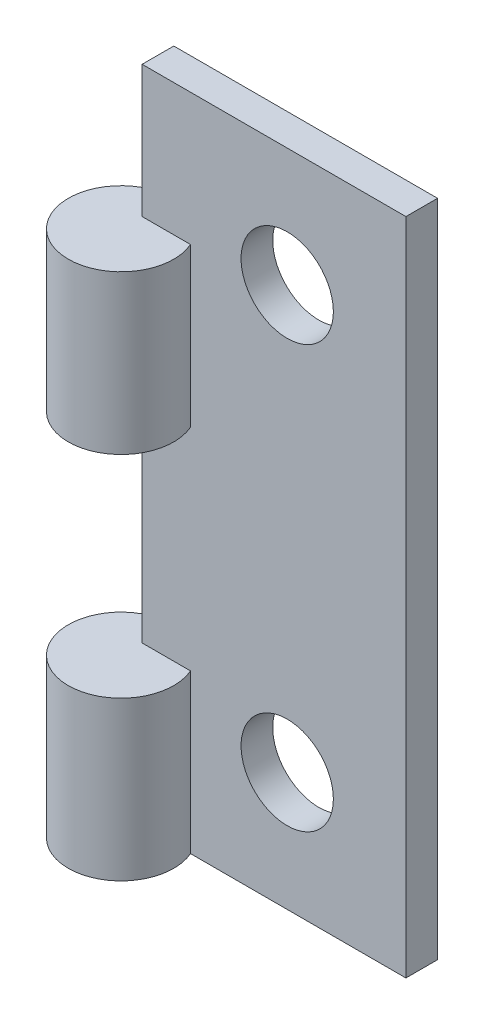
ISO-10303-21;
HEADER;
FILE_DESCRIPTION(('STEP AP214'),'2;1');
FILE_NAME('part.step','',(''),(''),'','','');
FILE_SCHEMA(('AUTOMOTIVE_DESIGN { 1 0 10303 214 1 1 1 1 }'));
ENDSEC;
DATA;
#1=APPLICATION_CONTEXT('core data for automotive mechanical design processes');
#2=APPLICATION_PROTOCOL_DEFINITION('international standard','automotive_design',2000,#1);
#3=PRODUCT_CONTEXT('',#1,'mechanical');
#4=PRODUCT('Part','Part','',(#3));
#5=PRODUCT_RELATED_PRODUCT_CATEGORY('part','',(#4));
#6=PRODUCT_DEFINITION_FORMATION('','',#4);
#7=PRODUCT_DEFINITION_CONTEXT('part definition',#1,'design');
#8=PRODUCT_DEFINITION('design','',#6,#7);
#9=PRODUCT_DEFINITION_SHAPE('','',#8);
#10=(LENGTH_UNIT() NAMED_UNIT(*) SI_UNIT(.MILLI.,.METRE.));
#11=(NAMED_UNIT(*) PLANE_ANGLE_UNIT() SI_UNIT($,.RADIAN.));
#12=(NAMED_UNIT(*) SI_UNIT($,.STERADIAN.) SOLID_ANGLE_UNIT());
#13=UNCERTAINTY_MEASURE_WITH_UNIT(LENGTH_MEASURE(1.E-05),#10,'distance_accuracy_value','');
#14=(GEOMETRIC_REPRESENTATION_CONTEXT(3) GLOBAL_UNCERTAINTY_ASSIGNED_CONTEXT((#13)) GLOBAL_UNIT_ASSIGNED_CONTEXT((#10,
#11,#12)) REPRESENTATION_CONTEXT('',''));
#15=CARTESIAN_POINT('',(0.,0.,0.));
#16=DIRECTION('',(0.,0.,1.));
#17=DIRECTION('',(1.,0.,0.));
#18=AXIS2_PLACEMENT_3D('',#15,#16,#17);
#19=CARTESIAN_POINT('',(-5.,-12.5,1.2));
#20=DIRECTION('',(1.,0.,0.));
#21=DIRECTION('',(0.,0.,-1.));
#22=AXIS2_PLACEMENT_3D('',#19,#20,#21);
#23=PLANE('',#22);
#24=DIRECTION('',(0.,0.,-1.));
#25=VECTOR('',#24,1.);
#26=CARTESIAN_POINT('',(-5.,7.5,1.2));
#27=LINE('',#26,#25);
#28=CARTESIAN_POINT('',(-5.,7.5,1.2));
#29=VERTEX_POINT('',#28);
#30=CARTESIAN_POINT('',(-5.,7.5,0.));
#31=VERTEX_POINT('',#30);
#32=EDGE_CURVE('E139',#29,#31,#27,.T.);
#33=ORIENTED_EDGE('',*,*,#32,.F.);
#34=DIRECTION('',(0.,-1.,0.));
#35=VECTOR('',#34,1.);
#36=CARTESIAN_POINT('',(-5.,-12.5,1.2));
#37=LINE('',#36,#35);
#38=CARTESIAN_POINT('',(-5.,12.5,1.2));
#39=VERTEX_POINT('',#38);
#40=EDGE_CURVE('E174',#39,#29,#37,.T.);
#41=ORIENTED_EDGE('',*,*,#40,.F.);
#42=DIRECTION('',(0.,0.,-1.));
#43=VECTOR('',#42,1.);
#44=CARTESIAN_POINT('',(-5.,12.5,1.2));
#45=LINE('',#44,#43);
#46=CARTESIAN_POINT('',(-5.,12.5,0.));
#47=VERTEX_POINT('',#46);
#48=EDGE_CURVE('E185',#39,#47,#45,.T.);
#49=ORIENTED_EDGE('',*,*,#48,.T.);
#50=DIRECTION('',(0.,-1.,0.));
#51=VECTOR('',#50,1.);
#52=CARTESIAN_POINT('',(-5.,-12.5,0.));
#53=LINE('',#52,#51);
#54=EDGE_CURVE('E116',#47,#31,#53,.T.);
#55=ORIENTED_EDGE('',*,*,#54,.T.);
#56=EDGE_LOOP('',(#33,#41,#49,#55));
#57=FACE_BOUND('',#56,.T.);
#58=ADVANCED_FACE('F34',(#57),#23,.F.);
#59=CARTESIAN_POINT('',(0.,0.,1.2));
#60=DIRECTION('',(0.,0.,-1.));
#61=DIRECTION('',(-1.,0.,0.));
#62=AXIS2_PLACEMENT_3D('',#59,#60,#61);
#63=PLANE('',#62);
#64=CARTESIAN_POINT('',(0.5,-8.,1.2));
#65=DIRECTION('',(0.,0.,1.));
#66=DIRECTION('',(1.,0.,0.));
#67=AXIS2_PLACEMENT_3D('',#64,#65,#66);
#68=CIRCLE('',#67,1.75);
#69=CARTESIAN_POINT('',(2.25,-8.,1.2));
#70=VERTEX_POINT('',#69);
#71=EDGE_CURVE('E156',#70,#70,#68,.T.);
#72=ORIENTED_EDGE('',*,*,#71,.F.);
#73=EDGE_LOOP('',(#72));
#74=FACE_BOUND('',#73,.T.);
#75=CARTESIAN_POINT('',(0.5,8.,1.2));
#76=DIRECTION('',(0.,0.,1.));
#77=DIRECTION('',(1.,0.,0.));
#78=AXIS2_PLACEMENT_3D('',#75,#76,#77);
#79=CIRCLE('',#78,1.75);
#80=CARTESIAN_POINT('',(2.25,8.,1.2));
#81=VERTEX_POINT('',#80);
#82=EDGE_CURVE('E162',#81,#81,#79,.T.);
#83=ORIENTED_EDGE('',*,*,#82,.F.);
#84=EDGE_LOOP('',(#83));
#85=FACE_BOUND('',#84,.T.);
#86=DIRECTION('',(-1.,0.,0.));
#87=VECTOR('',#86,1.);
#88=CARTESIAN_POINT('',(0.,7.5,1.2));
#89=LINE('',#88,#87);
#90=CARTESIAN_POINT('',(-3.16696972201766,7.5,1.2));
#91=VERTEX_POINT('',#90);
#92=EDGE_CURVE('E49',#91,#29,#89,.T.);
#93=ORIENTED_EDGE('',*,*,#92,.F.);
#94=DIRECTION('',(0.,-1.,0.));
#95=VECTOR('',#94,1.);
#96=CARTESIAN_POINT('',(-3.16696972201766,7.5,1.2));
#97=LINE('',#96,#95);
#98=CARTESIAN_POINT('',(-3.16696972201766,1.5,1.2));
#99=VERTEX_POINT('',#98);
#100=EDGE_CURVE('E53',#91,#99,#97,.T.);
#101=ORIENTED_EDGE('',*,*,#100,.T.);
#102=DIRECTION('',(-1.,0.,0.));
#103=VECTOR('',#102,1.);
#104=CARTESIAN_POINT('',(0.,1.5,1.2));
#105=LINE('',#104,#103);
#106=CARTESIAN_POINT('',(-5.,1.5,1.2));
#107=VERTEX_POINT('',#106);
#108=EDGE_CURVE('E124',#99,#107,#105,.T.);
#109=ORIENTED_EDGE('',*,*,#108,.T.);
#110=CARTESIAN_POINT('',(-5.,-6.5,1.2));
#111=VERTEX_POINT('',#110);
#112=EDGE_CURVE('E121',#107,#111,#37,.T.);
#113=ORIENTED_EDGE('',*,*,#112,.T.);
#114=DIRECTION('',(-1.,0.,0.));
#115=VECTOR('',#114,1.);
#116=CARTESIAN_POINT('',(0.,-6.5,1.2));
#117=LINE('',#116,#115);
#118=CARTESIAN_POINT('',(-3.16696972201766,-6.5,1.2));
#119=VERTEX_POINT('',#118);
#120=EDGE_CURVE('E152',#119,#111,#117,.T.);
#121=ORIENTED_EDGE('',*,*,#120,.F.);
#122=DIRECTION('',(0.,-1.,0.));
#123=VECTOR('',#122,1.);
#124=CARTESIAN_POINT('',(-3.16696972201766,-6.5,1.2));
#125=LINE('',#124,#123);
#126=CARTESIAN_POINT('',(-3.16696972201766,-12.5,1.2));
#127=VERTEX_POINT('',#126);
#128=EDGE_CURVE('E149',#119,#127,#125,.T.);
#129=ORIENTED_EDGE('',*,*,#128,.T.);
#130=DIRECTION('',(1.,0.,0.));
#131=VECTOR('',#130,1.);
#132=CARTESIAN_POINT('',(-5.,-12.5,1.2));
#133=LINE('',#132,#131);
#134=CARTESIAN_POINT('',(5.,-12.5,1.2));
#135=VERTEX_POINT('',#134);
#136=EDGE_CURVE('E176',#127,#135,#133,.T.);
#137=ORIENTED_EDGE('',*,*,#136,.T.);
#138=DIRECTION('',(0.,1.,0.));
#139=VECTOR('',#138,1.);
#140=CARTESIAN_POINT('',(5.,-12.5,1.2));
#141=LINE('',#140,#139);
#142=CARTESIAN_POINT('',(5.,12.5,1.2));
#143=VERTEX_POINT('',#142);
#144=EDGE_CURVE('E168',#135,#143,#141,.T.);
#145=ORIENTED_EDGE('',*,*,#144,.T.);
#146=DIRECTION('',(-1.,0.,0.));
#147=VECTOR('',#146,1.);
#148=CARTESIAN_POINT('',(-5.,12.5,1.2));
#149=LINE('',#148,#147);
#150=EDGE_CURVE('E171',#143,#39,#149,.T.);
#151=ORIENTED_EDGE('',*,*,#150,.T.);
#152=ORIENTED_EDGE('',*,*,#40,.T.);
#153=EDGE_LOOP('',(#93,#101,#109,#113,#121,#129,#137,#145,#151,#152));
#154=FACE_BOUND('',#153,.T.);
#155=ADVANCED_FACE('F209',(#74,#85,#154),#63,.F.);
#156=ORIENTED_EDGE('',*,*,#112,.F.);
#157=DIRECTION('',(0.,0.,-1.));
#158=VECTOR('',#157,1.);
#159=CARTESIAN_POINT('',(-5.,1.5,1.2));
#160=LINE('',#159,#158);
#161=CARTESIAN_POINT('',(-5.,1.5,0.));
#162=VERTEX_POINT('',#161);
#163=EDGE_CURVE('E119',#107,#162,#160,.T.);
#164=ORIENTED_EDGE('',*,*,#163,.T.);
#165=CARTESIAN_POINT('',(-5.,-6.5,0.));
#166=VERTEX_POINT('',#165);
#167=EDGE_CURVE('E100',#162,#166,#53,.T.);
#168=ORIENTED_EDGE('',*,*,#167,.T.);
#169=DIRECTION('',(0.,0.,-1.));
#170=VECTOR('',#169,1.);
#171=CARTESIAN_POINT('',(-5.,-6.5,1.2));
#172=LINE('',#171,#170);
#173=EDGE_CURVE('E11',#111,#166,#172,.T.);
#174=ORIENTED_EDGE('',*,*,#173,.F.);
#175=EDGE_LOOP('',(#156,#164,#168,#174));
#176=FACE_BOUND('',#175,.T.);
#177=ADVANCED_FACE('F120',(#176),#23,.F.);
#178=CARTESIAN_POINT('',(0.,0.,0.));
#179=DIRECTION('',(0.,0.,-1.));
#180=DIRECTION('',(-1.,0.,0.));
#181=AXIS2_PLACEMENT_3D('',#178,#179,#180);
#182=PLANE('',#181);
#183=CARTESIAN_POINT('',(0.5,8.,0.));
#184=DIRECTION('',(0.,0.,1.));
#185=DIRECTION('',(1.,0.,0.));
#186=AXIS2_PLACEMENT_3D('',#183,#184,#185);
#187=CIRCLE('',#186,1.75);
#188=CARTESIAN_POINT('',(2.25,8.,0.));
#189=VERTEX_POINT('',#188);
#190=EDGE_CURVE('E159',#189,#189,#187,.T.);
#191=ORIENTED_EDGE('',*,*,#190,.T.);
#192=EDGE_LOOP('',(#191));
#193=FACE_BOUND('',#192,.T.);
#194=DIRECTION('',(0.,1.,0.));
#195=VECTOR('',#194,1.);
#196=CARTESIAN_POINT('',(5.,-12.5,0.));
#197=LINE('',#196,#195);
#198=CARTESIAN_POINT('',(5.,-12.5,0.));
#199=VERTEX_POINT('',#198);
#200=CARTESIAN_POINT('',(5.,12.5,0.));
#201=VERTEX_POINT('',#200);
#202=EDGE_CURVE('E165',#199,#201,#197,.T.);
#203=ORIENTED_EDGE('',*,*,#202,.F.);
#204=DIRECTION('',(1.,0.,0.));
#205=VECTOR('',#204,1.);
#206=CARTESIAN_POINT('',(-5.,-12.5,0.));
#207=LINE('',#206,#205);
#208=CARTESIAN_POINT('',(-5.,-12.5,0.));
#209=VERTEX_POINT('',#208);
#210=EDGE_CURVE('E172',#209,#199,#207,.T.);
#211=ORIENTED_EDGE('',*,*,#210,.F.);
#212=DIRECTION('',(0.,-1.,0.));
#213=VECTOR('',#212,1.);
#214=CARTESIAN_POINT('',(-5.,-6.5,0.));
#215=LINE('',#214,#213);
#216=EDGE_CURVE('E111',#209,#166,#215,.F.);
#217=ORIENTED_EDGE('',*,*,#216,.T.);
#218=ORIENTED_EDGE('',*,*,#167,.F.);
#219=EDGE_CURVE('E107',#31,#162,#53,.T.);
#220=ORIENTED_EDGE('',*,*,#219,.F.);
#221=ORIENTED_EDGE('',*,*,#54,.F.);
#222=DIRECTION('',(-1.,0.,0.));
#223=VECTOR('',#222,1.);
#224=CARTESIAN_POINT('',(-5.,12.5,0.));
#225=LINE('',#224,#223);
#226=EDGE_CURVE('E114',#201,#47,#225,.T.);
#227=ORIENTED_EDGE('',*,*,#226,.F.);
#228=EDGE_LOOP('',(#203,#211,#217,#218,#220,#221,#227));
#229=FACE_BOUND('',#228,.T.);
#230=CARTESIAN_POINT('',(0.5,-8.,0.));
#231=DIRECTION('',(0.,0.,1.));
#232=DIRECTION('',(1.,0.,0.));
#233=AXIS2_PLACEMENT_3D('',#230,#231,#232);
#234=CIRCLE('',#233,1.75);
#235=CARTESIAN_POINT('',(2.25,-8.,0.));
#236=VERTEX_POINT('',#235);
#237=EDGE_CURVE('E155',#236,#236,#234,.T.);
#238=ORIENTED_EDGE('',*,*,#237,.T.);
#239=EDGE_LOOP('',(#238));
#240=FACE_BOUND('',#239,.T.);
#241=ADVANCED_FACE('F103',(#193,#229,#240),#182,.T.);
#242=CARTESIAN_POINT('',(5.,-12.5,1.2));
#243=DIRECTION('',(-1.,0.,0.));
#244=DIRECTION('',(0.,0.,1.));
#245=AXIS2_PLACEMENT_3D('',#242,#243,#244);
#246=PLANE('',#245);
#247=ORIENTED_EDGE('',*,*,#202,.T.);
#248=DIRECTION('',(0.,0.,-1.));
#249=VECTOR('',#248,1.);
#250=CARTESIAN_POINT('',(5.,12.5,1.2));
#251=LINE('',#250,#249);
#252=EDGE_CURVE('E42',#143,#201,#251,.T.);
#253=ORIENTED_EDGE('',*,*,#252,.F.);
#254=ORIENTED_EDGE('',*,*,#144,.F.);
#255=DIRECTION('',(0.,0.,-1.));
#256=VECTOR('',#255,1.);
#257=CARTESIAN_POINT('',(5.,-12.5,1.2));
#258=LINE('',#257,#256);
#259=EDGE_CURVE('E178',#135,#199,#258,.T.);
#260=ORIENTED_EDGE('',*,*,#259,.T.);
#261=EDGE_LOOP('',(#247,#253,#254,#260));
#262=FACE_BOUND('',#261,.T.);
#263=ADVANCED_FACE('F36',(#262),#246,.F.);
#264=CARTESIAN_POINT('',(-5.,12.5,1.2));
#265=DIRECTION('',(0.,-1.,0.));
#266=DIRECTION('',(0.,0.,-1.));
#267=AXIS2_PLACEMENT_3D('',#264,#265,#266);
#268=PLANE('',#267);
#269=ORIENTED_EDGE('',*,*,#226,.T.);
#270=ORIENTED_EDGE('',*,*,#48,.F.);
#271=ORIENTED_EDGE('',*,*,#150,.F.);
#272=ORIENTED_EDGE('',*,*,#252,.T.);
#273=EDGE_LOOP('',(#269,#270,#271,#272));
#274=FACE_BOUND('',#273,.T.);
#275=ADVANCED_FACE('F190',(#274),#268,.F.);
#276=CARTESIAN_POINT('',(-5.,-12.5,1.2));
#277=DIRECTION('',(0.,1.,0.));
#278=DIRECTION('',(0.,0.,1.));
#279=AXIS2_PLACEMENT_3D('',#276,#277,#278);
#280=PLANE('',#279);
#281=ORIENTED_EDGE('',*,*,#136,.F.);
#282=CARTESIAN_POINT('',(-5.,-12.5,2.));
#283=DIRECTION('',(0.,-1.,0.));
#284=DIRECTION('',(0.,0.,-1.));
#285=AXIS2_PLACEMENT_3D('',#282,#283,#284);
#286=CIRCLE('',#285,2.);
#287=EDGE_CURVE('E143',#127,#209,#286,.T.);
#288=ORIENTED_EDGE('',*,*,#287,.T.);
#289=ORIENTED_EDGE('',*,*,#210,.T.);
#290=ORIENTED_EDGE('',*,*,#259,.F.);
#291=EDGE_LOOP('',(#281,#288,#289,#290));
#292=FACE_BOUND('',#291,.T.);
#293=ADVANCED_FACE('F227',(#292),#280,.F.);
#294=CARTESIAN_POINT('',(0.5,8.,1.2));
#295=DIRECTION('',(0.,0.,-1.));
#296=DIRECTION('',(-1.,0.,0.));
#297=AXIS2_PLACEMENT_3D('',#294,#295,#296);
#298=CYLINDRICAL_SURFACE('',#297,1.75);
#299=ORIENTED_EDGE('',*,*,#82,.T.);
#300=EDGE_LOOP('',(#299));
#301=FACE_BOUND('',#300,.T.);
#302=ORIENTED_EDGE('',*,*,#190,.F.);
#303=EDGE_LOOP('',(#302));
#304=FACE_BOUND('',#303,.T.);
#305=ADVANCED_FACE('F229',(#301,#304),#298,.F.);
#306=CARTESIAN_POINT('',(0.5,-8.,1.2));
#307=DIRECTION('',(0.,0.,-1.));
#308=DIRECTION('',(-1.,0.,0.));
#309=AXIS2_PLACEMENT_3D('',#306,#307,#308);
#310=CYLINDRICAL_SURFACE('',#309,1.75);
#311=ORIENTED_EDGE('',*,*,#71,.T.);
#312=EDGE_LOOP('',(#311));
#313=FACE_BOUND('',#312,.T.);
#314=ORIENTED_EDGE('',*,*,#237,.F.);
#315=EDGE_LOOP('',(#314));
#316=FACE_BOUND('',#315,.T.);
#317=ADVANCED_FACE('F235',(#313,#316),#310,.F.);
#318=CARTESIAN_POINT('',(-5.,-6.5,2.));
#319=DIRECTION('',(0.,-1.,0.));
#320=DIRECTION('',(0.,0.,-1.));
#321=AXIS2_PLACEMENT_3D('',#318,#319,#320);
#322=PLANE('',#321);
#323=CARTESIAN_POINT('',(-5.,-6.5,2.));
#324=DIRECTION('',(0.,-1.,0.));
#325=DIRECTION('',(0.,0.,-1.));
#326=AXIS2_PLACEMENT_3D('',#323,#324,#325);
#327=CIRCLE('',#326,2.);
#328=EDGE_CURVE('E144',#119,#166,#327,.T.);
#329=ORIENTED_EDGE('',*,*,#328,.F.);
#330=ORIENTED_EDGE('',*,*,#120,.T.);
#331=ORIENTED_EDGE('',*,*,#173,.T.);
#332=EDGE_LOOP('',(#329,#330,#331));
#333=FACE_BOUND('',#332,.T.);
#334=ADVANCED_FACE('F242',(#333),#322,.F.);
#335=CARTESIAN_POINT('',(-5.,-6.5,2.));
#336=DIRECTION('',(0.,-1.,0.));
#337=DIRECTION('',(0.,0.,-1.));
#338=AXIS2_PLACEMENT_3D('',#335,#336,#337);
#339=CYLINDRICAL_SURFACE('',#338,2.);
#340=ORIENTED_EDGE('',*,*,#128,.F.);
#341=ORIENTED_EDGE('',*,*,#328,.T.);
#342=ORIENTED_EDGE('',*,*,#216,.F.);
#343=ORIENTED_EDGE('',*,*,#287,.F.);
#344=EDGE_LOOP('',(#340,#341,#342,#343));
#345=FACE_BOUND('',#344,.T.);
#346=ADVANCED_FACE('F206',(#345),#339,.T.);
#347=CARTESIAN_POINT('',(-5.,7.5,2.));
#348=DIRECTION('',(0.,-1.,0.));
#349=DIRECTION('',(0.,0.,-1.));
#350=AXIS2_PLACEMENT_3D('',#347,#348,#349);
#351=CYLINDRICAL_SURFACE('',#350,2.);
#352=ORIENTED_EDGE('',*,*,#100,.F.);
#353=CARTESIAN_POINT('',(-5.,7.5,2.));
#354=DIRECTION('',(0.,-1.,0.));
#355=DIRECTION('',(0.,0.,-1.));
#356=AXIS2_PLACEMENT_3D('',#353,#354,#355);
#357=CIRCLE('',#356,2.);
#358=EDGE_CURVE('E132',#91,#31,#357,.T.);
#359=ORIENTED_EDGE('',*,*,#358,.T.);
#360=ORIENTED_EDGE('',*,*,#219,.T.);
#361=CARTESIAN_POINT('',(-5.,1.5,2.));
#362=DIRECTION('',(0.,-1.,0.));
#363=DIRECTION('',(0.,0.,-1.));
#364=AXIS2_PLACEMENT_3D('',#361,#362,#363);
#365=CIRCLE('',#364,2.);
#366=EDGE_CURVE('E130',#99,#162,#365,.T.);
#367=ORIENTED_EDGE('',*,*,#366,.F.);
#368=EDGE_LOOP('',(#352,#359,#360,#367));
#369=FACE_BOUND('',#368,.T.);
#370=ADVANCED_FACE('F129',(#369),#351,.T.);
#371=CARTESIAN_POINT('',(-5.,7.5,2.));
#372=DIRECTION('',(0.,-1.,0.));
#373=DIRECTION('',(0.,0.,-1.));
#374=AXIS2_PLACEMENT_3D('',#371,#372,#373);
#375=PLANE('',#374);
#376=ORIENTED_EDGE('',*,*,#92,.T.);
#377=ORIENTED_EDGE('',*,*,#32,.T.);
#378=ORIENTED_EDGE('',*,*,#358,.F.);
#379=EDGE_LOOP('',(#376,#377,#378));
#380=FACE_BOUND('',#379,.T.);
#381=ADVANCED_FACE('F198',(#380),#375,.F.);
#382=CARTESIAN_POINT('',(-5.,1.5,2.));
#383=DIRECTION('',(0.,-1.,0.));
#384=DIRECTION('',(0.,0.,-1.));
#385=AXIS2_PLACEMENT_3D('',#382,#383,#384);
#386=PLANE('',#385);
#387=ORIENTED_EDGE('',*,*,#163,.F.);
#388=ORIENTED_EDGE('',*,*,#108,.F.);
#389=ORIENTED_EDGE('',*,*,#366,.T.);
#390=EDGE_LOOP('',(#387,#388,#389));
#391=FACE_BOUND('',#390,.T.);
#392=ADVANCED_FACE('F133',(#391),#386,.T.);
#393=CLOSED_SHELL('',(#58,#155,#177,#241,#263,#275,#293,#305,#317,#334,#346,#370,#381,#392));
#394=MANIFOLD_SOLID_BREP('B2',#393);
#395=ADVANCED_BREP_SHAPE_REPRESENTATION('',(#18,#394),#14);
#396=SHAPE_DEFINITION_REPRESENTATION(#9,#395);
ENDSEC;
END-ISO-10303-21;
